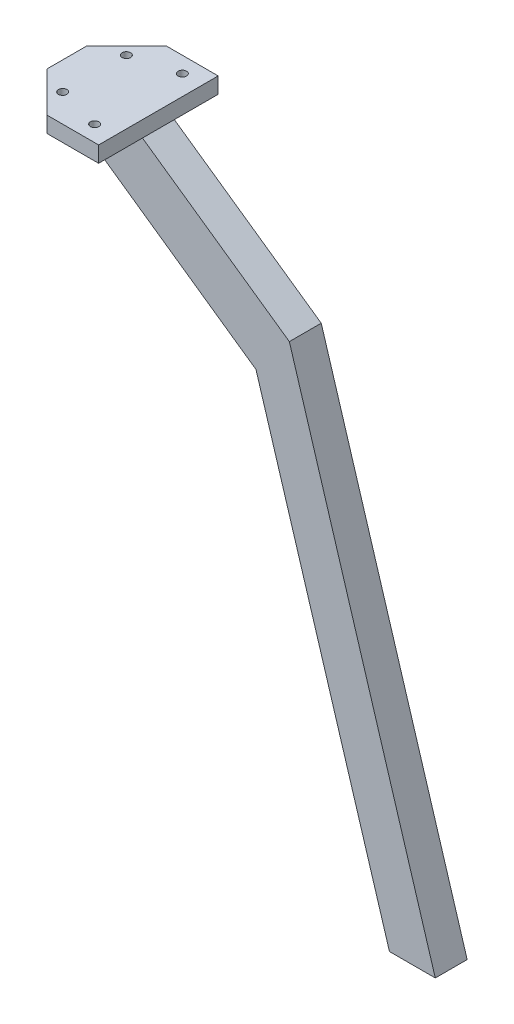
ISO-10303-21;
HEADER;
FILE_DESCRIPTION(('STEP AP214'),'2;1');
FILE_NAME('part.step','',(''),(''),'','','');
FILE_SCHEMA(('AUTOMOTIVE_DESIGN { 1 0 10303 214 1 1 1 1 }'));
ENDSEC;
DATA;
#1=APPLICATION_CONTEXT('core data for automotive mechanical design processes');
#2=APPLICATION_PROTOCOL_DEFINITION('international standard','automotive_design',2000,#1);
#3=PRODUCT_CONTEXT('',#1,'mechanical');
#4=PRODUCT('Part','Part','',(#3));
#5=PRODUCT_RELATED_PRODUCT_CATEGORY('part','',(#4));
#6=PRODUCT_DEFINITION_FORMATION('','',#4);
#7=PRODUCT_DEFINITION_CONTEXT('part definition',#1,'design');
#8=PRODUCT_DEFINITION('design','',#6,#7);
#9=PRODUCT_DEFINITION_SHAPE('','',#8);
#10=(LENGTH_UNIT() NAMED_UNIT(*) SI_UNIT(.MILLI.,.METRE.));
#11=(NAMED_UNIT(*) PLANE_ANGLE_UNIT() SI_UNIT($,.RADIAN.));
#12=(NAMED_UNIT(*) SI_UNIT($,.STERADIAN.) SOLID_ANGLE_UNIT());
#13=UNCERTAINTY_MEASURE_WITH_UNIT(LENGTH_MEASURE(1.E-05),#10,'distance_accuracy_value','');
#14=(GEOMETRIC_REPRESENTATION_CONTEXT(3) GLOBAL_UNCERTAINTY_ASSIGNED_CONTEXT((#13)) GLOBAL_UNIT_ASSIGNED_CONTEXT((#10,
#11,#12)) REPRESENTATION_CONTEXT('',''));
#15=CARTESIAN_POINT('',(0.,0.,0.));
#16=DIRECTION('',(0.,0.,1.));
#17=DIRECTION('',(1.,0.,0.));
#18=AXIS2_PLACEMENT_3D('',#15,#16,#17);
#19=CARTESIAN_POINT('',(0.,0.,0.));
#20=DIRECTION('',(0.,-1.,0.));
#21=DIRECTION('',(0.,0.,-1.));
#22=AXIS2_PLACEMENT_3D('',#19,#20,#21);
#23=PLANE('',#22);
#24=CARTESIAN_POINT('',(6.96945989785264,0.,-23.));
#25=DIRECTION('',(0.,1.,0.));
#26=DIRECTION('',(0.,0.,1.));
#27=AXIS2_PLACEMENT_3D('',#24,#25,#26);
#28=CIRCLE('',#27,1.06398593230415);
#29=CARTESIAN_POINT('',(6.96945989785264,0.,-21.9360140676959));
#30=VERTEX_POINT('',#29);
#31=EDGE_CURVE('E184',#30,#30,#28,.T.);
#32=ORIENTED_EDGE('',*,*,#31,.T.);
#33=EDGE_LOOP('',(#32));
#34=FACE_BOUND('',#33,.T.);
#35=CARTESIAN_POINT('',(18.,0.,-26.));
#36=DIRECTION('',(0.,1.,0.));
#37=DIRECTION('',(0.,0.,1.));
#38=AXIS2_PLACEMENT_3D('',#35,#36,#37);
#39=CIRCLE('',#38,1.06398593230415);
#40=CARTESIAN_POINT('',(18.,0.,-24.9360140676959));
#41=VERTEX_POINT('',#40);
#42=EDGE_CURVE('E183',#41,#41,#39,.T.);
#43=ORIENTED_EDGE('',*,*,#42,.T.);
#44=EDGE_LOOP('',(#43));
#45=FACE_BOUND('',#44,.T.);
#46=DIRECTION('',(0.,0.,-1.));
#47=VECTOR('',#46,1.);
#48=CARTESIAN_POINT('',(23.,0.,0.));
#49=LINE('',#48,#47);
#50=CARTESIAN_POINT('',(23.,0.,-19.));
#51=VERTEX_POINT('',#50);
#52=CARTESIAN_POINT('',(23.,0.,-30.));
#53=VERTEX_POINT('',#52);
#54=EDGE_CURVE('E141',#51,#53,#49,.T.);
#55=ORIENTED_EDGE('',*,*,#54,.F.);
#56=DIRECTION('',(-1.,0.,0.));
#57=VECTOR('',#56,1.);
#58=CARTESIAN_POINT('',(0.,0.,-19.));
#59=LINE('',#58,#57);
#60=CARTESIAN_POINT('',(0.,0.,-19.));
#61=VERTEX_POINT('',#60);
#62=EDGE_CURVE('E162',#51,#61,#59,.T.);
#63=ORIENTED_EDGE('',*,*,#62,.T.);
#64=DIRECTION('',(0.,0.,1.));
#65=VECTOR('',#64,1.);
#66=CARTESIAN_POINT('',(0.,0.,-10.));
#67=LINE('',#66,#65);
#68=CARTESIAN_POINT('',(0.,0.,-20.));
#69=VERTEX_POINT('',#68);
#70=EDGE_CURVE('E145',#69,#61,#67,.T.);
#71=ORIENTED_EDGE('',*,*,#70,.F.);
#72=DIRECTION('',(-0.707106781186547,0.,0.707106781186548));
#73=VECTOR('',#72,1.);
#74=CARTESIAN_POINT('',(0.,0.,-20.));
#75=LINE('',#74,#73);
#76=CARTESIAN_POINT('',(10.,0.,-30.));
#77=VERTEX_POINT('',#76);
#78=EDGE_CURVE('E143',#77,#69,#75,.T.);
#79=ORIENTED_EDGE('',*,*,#78,.F.);
#80=DIRECTION('',(-1.,0.,0.));
#81=VECTOR('',#80,1.);
#82=CARTESIAN_POINT('',(10.,0.,-30.));
#83=LINE('',#82,#81);
#84=EDGE_CURVE('E140',#53,#77,#83,.T.);
#85=ORIENTED_EDGE('',*,*,#84,.F.);
#86=EDGE_LOOP('',(#55,#63,#71,#79,#85));
#87=FACE_BOUND('',#86,.T.);
#88=ADVANCED_FACE('F38',(#34,#45,#87),#23,.T.);
#89=CARTESIAN_POINT('',(0.,4.,0.));
#90=DIRECTION('',(0.,-1.,0.));
#91=DIRECTION('',(0.,0.,-1.));
#92=AXIS2_PLACEMENT_3D('',#89,#90,#91);
#93=PLANE('',#92);
#94=DIRECTION('',(0.,0.,-1.));
#95=VECTOR('',#94,1.);
#96=CARTESIAN_POINT('',(23.,4.,0.));
#97=LINE('',#96,#95);
#98=CARTESIAN_POINT('',(23.,4.,0.));
#99=VERTEX_POINT('',#98);
#100=CARTESIAN_POINT('',(23.,4.,-30.));
#101=VERTEX_POINT('',#100);
#102=EDGE_CURVE('E150',#99,#101,#97,.T.);
#103=ORIENTED_EDGE('',*,*,#102,.T.);
#104=DIRECTION('',(-1.,0.,0.));
#105=VECTOR('',#104,1.);
#106=CARTESIAN_POINT('',(10.,4.,-30.));
#107=LINE('',#106,#105);
#108=CARTESIAN_POINT('',(10.,4.,-30.));
#109=VERTEX_POINT('',#108);
#110=EDGE_CURVE('E97',#101,#109,#107,.T.);
#111=ORIENTED_EDGE('',*,*,#110,.T.);
#112=DIRECTION('',(-0.707106781186547,0.,0.707106781186548));
#113=VECTOR('',#112,1.);
#114=CARTESIAN_POINT('',(0.,4.,-20.));
#115=LINE('',#114,#113);
#116=CARTESIAN_POINT('',(0.,4.,-20.));
#117=VERTEX_POINT('',#116);
#118=EDGE_CURVE('E114',#109,#117,#115,.T.);
#119=ORIENTED_EDGE('',*,*,#118,.T.);
#120=DIRECTION('',(0.,0.,1.));
#121=VECTOR('',#120,1.);
#122=CARTESIAN_POINT('',(0.,4.,-10.));
#123=LINE('',#122,#121);
#124=CARTESIAN_POINT('',(0.,4.,-10.));
#125=VERTEX_POINT('',#124);
#126=EDGE_CURVE('E106',#117,#125,#123,.T.);
#127=ORIENTED_EDGE('',*,*,#126,.T.);
#128=DIRECTION('',(0.707106781186548,0.,0.707106781186547));
#129=VECTOR('',#128,1.);
#130=CARTESIAN_POINT('',(10.,4.,0.));
#131=LINE('',#130,#129);
#132=CARTESIAN_POINT('',(10.,4.,0.));
#133=VERTEX_POINT('',#132);
#134=EDGE_CURVE('E111',#125,#133,#131,.T.);
#135=ORIENTED_EDGE('',*,*,#134,.T.);
#136=DIRECTION('',(1.,0.,0.));
#137=VECTOR('',#136,1.);
#138=CARTESIAN_POINT('',(10.,4.,0.));
#139=LINE('',#138,#137);
#140=EDGE_CURVE('E62',#133,#99,#139,.T.);
#141=ORIENTED_EDGE('',*,*,#140,.T.);
#142=EDGE_LOOP('',(#103,#111,#119,#127,#135,#141));
#143=FACE_BOUND('',#142,.T.);
#144=CARTESIAN_POINT('',(6.96945989785264,4.,-7.));
#145=DIRECTION('',(0.,1.,0.));
#146=DIRECTION('',(0.,0.,1.));
#147=AXIS2_PLACEMENT_3D('',#144,#145,#146);
#148=CIRCLE('',#147,1.06398593230415);
#149=CARTESIAN_POINT('',(6.96945989785264,4.,-5.93601406769585));
#150=VERTEX_POINT('',#149);
#151=EDGE_CURVE('E200',#150,#150,#148,.T.);
#152=ORIENTED_EDGE('',*,*,#151,.F.);
#153=EDGE_LOOP('',(#152));
#154=FACE_BOUND('',#153,.T.);
#155=CARTESIAN_POINT('',(18.,4.,-4.));
#156=DIRECTION('',(0.,1.,0.));
#157=DIRECTION('',(0.,0.,1.));
#158=AXIS2_PLACEMENT_3D('',#155,#156,#157);
#159=CIRCLE('',#158,1.06398593230415);
#160=CARTESIAN_POINT('',(18.,4.,-2.93601406769585));
#161=VERTEX_POINT('',#160);
#162=EDGE_CURVE('E194',#161,#161,#159,.T.);
#163=ORIENTED_EDGE('',*,*,#162,.F.);
#164=EDGE_LOOP('',(#163));
#165=FACE_BOUND('',#164,.T.);
#166=CARTESIAN_POINT('',(18.,4.,-26.));
#167=DIRECTION('',(0.,1.,0.));
#168=DIRECTION('',(0.,0.,1.));
#169=AXIS2_PLACEMENT_3D('',#166,#167,#168);
#170=CIRCLE('',#169,1.06398593230415);
#171=CARTESIAN_POINT('',(18.,4.,-24.9360140676959));
#172=VERTEX_POINT('',#171);
#173=EDGE_CURVE('E188',#172,#172,#170,.T.);
#174=ORIENTED_EDGE('',*,*,#173,.F.);
#175=EDGE_LOOP('',(#174));
#176=FACE_BOUND('',#175,.T.);
#177=CARTESIAN_POINT('',(6.96945989785264,4.,-23.));
#178=DIRECTION('',(0.,1.,0.));
#179=DIRECTION('',(0.,0.,1.));
#180=AXIS2_PLACEMENT_3D('',#177,#178,#179);
#181=CIRCLE('',#180,1.06398593230415);
#182=CARTESIAN_POINT('',(6.96945989785264,4.,-21.9360140676959));
#183=VERTEX_POINT('',#182);
#184=EDGE_CURVE('E180',#183,#183,#181,.T.);
#185=ORIENTED_EDGE('',*,*,#184,.F.);
#186=EDGE_LOOP('',(#185));
#187=FACE_BOUND('',#186,.T.);
#188=ADVANCED_FACE('F108',(#143,#154,#165,#176,#187),#93,.F.);
#189=DIRECTION('',(-1.,0.,0.));
#190=VECTOR('',#189,1.);
#191=CARTESIAN_POINT('',(0.,0.,-11.));
#192=LINE('',#191,#190);
#193=CARTESIAN_POINT('',(23.,0.,-11.));
#194=VERTEX_POINT('',#193);
#195=CARTESIAN_POINT('',(0.,0.,-11.));
#196=VERTEX_POINT('',#195);
#197=EDGE_CURVE('E236',#194,#196,#192,.T.);
#198=ORIENTED_EDGE('',*,*,#197,.F.);
#199=CARTESIAN_POINT('',(23.,0.,0.));
#200=VERTEX_POINT('',#199);
#201=EDGE_CURVE('E137',#200,#194,#49,.T.);
#202=ORIENTED_EDGE('',*,*,#201,.F.);
#203=DIRECTION('',(1.,0.,0.));
#204=VECTOR('',#203,1.);
#205=CARTESIAN_POINT('',(10.,0.,0.));
#206=LINE('',#205,#204);
#207=CARTESIAN_POINT('',(10.,0.,0.));
#208=VERTEX_POINT('',#207);
#209=EDGE_CURVE('E89',#208,#200,#206,.T.);
#210=ORIENTED_EDGE('',*,*,#209,.F.);
#211=DIRECTION('',(0.707106781186548,0.,0.707106781186547));
#212=VECTOR('',#211,1.);
#213=CARTESIAN_POINT('',(10.,0.,0.));
#214=LINE('',#213,#212);
#215=CARTESIAN_POINT('',(0.,0.,-10.));
#216=VERTEX_POINT('',#215);
#217=EDGE_CURVE('E147',#216,#208,#214,.T.);
#218=ORIENTED_EDGE('',*,*,#217,.F.);
#219=EDGE_CURVE('E125',#196,#216,#67,.T.);
#220=ORIENTED_EDGE('',*,*,#219,.F.);
#221=EDGE_LOOP('',(#198,#202,#210,#218,#220));
#222=FACE_BOUND('',#221,.T.);
#223=CARTESIAN_POINT('',(6.96945989785264,0.,-7.));
#224=DIRECTION('',(0.,1.,0.));
#225=DIRECTION('',(0.,0.,1.));
#226=AXIS2_PLACEMENT_3D('',#223,#224,#225);
#227=CIRCLE('',#226,1.06398593230415);
#228=CARTESIAN_POINT('',(6.96945989785264,0.,-5.93601406769585));
#229=VERTEX_POINT('',#228);
#230=EDGE_CURVE('E197',#229,#229,#227,.T.);
#231=ORIENTED_EDGE('',*,*,#230,.T.);
#232=EDGE_LOOP('',(#231));
#233=FACE_BOUND('',#232,.T.);
#234=CARTESIAN_POINT('',(18.,0.,-4.));
#235=DIRECTION('',(0.,1.,0.));
#236=DIRECTION('',(0.,0.,1.));
#237=AXIS2_PLACEMENT_3D('',#234,#235,#236);
#238=CIRCLE('',#237,1.06398593230415);
#239=CARTESIAN_POINT('',(18.,0.,-2.93601406769585));
#240=VERTEX_POINT('',#239);
#241=EDGE_CURVE('E191',#240,#240,#238,.T.);
#242=ORIENTED_EDGE('',*,*,#241,.T.);
#243=EDGE_LOOP('',(#242));
#244=FACE_BOUND('',#243,.T.);
#245=ADVANCED_FACE('F217',(#222,#233,#244),#23,.T.);
#246=CARTESIAN_POINT('',(23.,4.,0.));
#247=DIRECTION('',(-1.,0.,0.));
#248=DIRECTION('',(0.,0.,1.));
#249=AXIS2_PLACEMENT_3D('',#246,#247,#248);
#250=PLANE('',#249);
#251=ORIENTED_EDGE('',*,*,#201,.T.);
#252=DIRECTION('',(0.,0.,1.));
#253=VECTOR('',#252,1.);
#254=CARTESIAN_POINT('',(23.,0.,-19.));
#255=LINE('',#254,#253);
#256=EDGE_CURVE('E187',#51,#194,#255,.T.);
#257=ORIENTED_EDGE('',*,*,#256,.F.);
#258=ORIENTED_EDGE('',*,*,#54,.T.);
#259=DIRECTION('',(0.,-1.,0.));
#260=VECTOR('',#259,1.);
#261=CARTESIAN_POINT('',(23.,4.,-30.));
#262=LINE('',#261,#260);
#263=EDGE_CURVE('E11',#101,#53,#262,.T.);
#264=ORIENTED_EDGE('',*,*,#263,.F.);
#265=ORIENTED_EDGE('',*,*,#102,.F.);
#266=DIRECTION('',(0.,-1.,0.));
#267=VECTOR('',#266,1.);
#268=CARTESIAN_POINT('',(23.,4.,0.));
#269=LINE('',#268,#267);
#270=EDGE_CURVE('E133',#99,#200,#269,.T.);
#271=ORIENTED_EDGE('',*,*,#270,.T.);
#272=EDGE_LOOP('',(#251,#257,#258,#264,#265,#271));
#273=FACE_BOUND('',#272,.T.);
#274=ADVANCED_FACE('F40',(#273),#250,.F.);
#275=CARTESIAN_POINT('',(10.,4.,-30.));
#276=DIRECTION('',(0.,0.,1.));
#277=DIRECTION('',(1.,0.,0.));
#278=AXIS2_PLACEMENT_3D('',#275,#276,#277);
#279=PLANE('',#278);
#280=ORIENTED_EDGE('',*,*,#84,.T.);
#281=DIRECTION('',(0.,-1.,0.));
#282=VECTOR('',#281,1.);
#283=CARTESIAN_POINT('',(10.,4.,-30.));
#284=LINE('',#283,#282);
#285=EDGE_CURVE('E46',#109,#77,#284,.T.);
#286=ORIENTED_EDGE('',*,*,#285,.F.);
#287=ORIENTED_EDGE('',*,*,#110,.F.);
#288=ORIENTED_EDGE('',*,*,#263,.T.);
#289=EDGE_LOOP('',(#280,#286,#287,#288));
#290=FACE_BOUND('',#289,.T.);
#291=ADVANCED_FACE('F210',(#290),#279,.F.);
#292=CARTESIAN_POINT('',(0.,4.,-20.));
#293=DIRECTION('',(0.707106781186548,0.,0.707106781186547));
#294=DIRECTION('',(0.707106781186547,0.,-0.707106781186548));
#295=AXIS2_PLACEMENT_3D('',#292,#293,#294);
#296=PLANE('',#295);
#297=ORIENTED_EDGE('',*,*,#78,.T.);
#298=DIRECTION('',(0.,-1.,0.));
#299=VECTOR('',#298,1.);
#300=CARTESIAN_POINT('',(0.,4.,-20.));
#301=LINE('',#300,#299);
#302=EDGE_CURVE('E128',#117,#69,#301,.T.);
#303=ORIENTED_EDGE('',*,*,#302,.F.);
#304=ORIENTED_EDGE('',*,*,#118,.F.);
#305=ORIENTED_EDGE('',*,*,#285,.T.);
#306=EDGE_LOOP('',(#297,#303,#304,#305));
#307=FACE_BOUND('',#306,.T.);
#308=ADVANCED_FACE('F156',(#307),#296,.F.);
#309=CARTESIAN_POINT('',(0.,4.,-10.));
#310=DIRECTION('',(1.,0.,0.));
#311=DIRECTION('',(0.,0.,-1.));
#312=AXIS2_PLACEMENT_3D('',#309,#310,#311);
#313=PLANE('',#312);
#314=ORIENTED_EDGE('',*,*,#70,.T.);
#315=DIRECTION('',(0.,0.,1.));
#316=VECTOR('',#315,1.);
#317=CARTESIAN_POINT('',(0.,0.,-19.));
#318=LINE('',#317,#316);
#319=EDGE_CURVE('E164',#61,#196,#318,.T.);
#320=ORIENTED_EDGE('',*,*,#319,.T.);
#321=ORIENTED_EDGE('',*,*,#219,.T.);
#322=DIRECTION('',(0.,-1.,0.));
#323=VECTOR('',#322,1.);
#324=CARTESIAN_POINT('',(0.,4.,-10.));
#325=LINE('',#324,#323);
#326=EDGE_CURVE('E120',#125,#216,#325,.T.);
#327=ORIENTED_EDGE('',*,*,#326,.F.);
#328=ORIENTED_EDGE('',*,*,#126,.F.);
#329=ORIENTED_EDGE('',*,*,#302,.T.);
#330=EDGE_LOOP('',(#314,#320,#321,#327,#328,#329));
#331=FACE_BOUND('',#330,.T.);
#332=ADVANCED_FACE('F122',(#331),#313,.F.);
#333=CARTESIAN_POINT('',(10.,4.,0.));
#334=DIRECTION('',(0.707106781186547,0.,-0.707106781186548));
#335=DIRECTION('',(-0.707106781186548,0.,-0.707106781186547));
#336=AXIS2_PLACEMENT_3D('',#333,#334,#335);
#337=PLANE('',#336);
#338=ORIENTED_EDGE('',*,*,#217,.T.);
#339=DIRECTION('',(0.,-1.,0.));
#340=VECTOR('',#339,1.);
#341=CARTESIAN_POINT('',(10.,4.,0.));
#342=LINE('',#341,#340);
#343=EDGE_CURVE('E129',#133,#208,#342,.T.);
#344=ORIENTED_EDGE('',*,*,#343,.F.);
#345=ORIENTED_EDGE('',*,*,#134,.F.);
#346=ORIENTED_EDGE('',*,*,#326,.T.);
#347=EDGE_LOOP('',(#338,#344,#345,#346));
#348=FACE_BOUND('',#347,.T.);
#349=ADVANCED_FACE('F131',(#348),#337,.F.);
#350=CARTESIAN_POINT('',(10.,4.,0.));
#351=DIRECTION('',(0.,0.,-1.));
#352=DIRECTION('',(-1.,0.,0.));
#353=AXIS2_PLACEMENT_3D('',#350,#351,#352);
#354=PLANE('',#353);
#355=ORIENTED_EDGE('',*,*,#209,.T.);
#356=ORIENTED_EDGE('',*,*,#270,.F.);
#357=ORIENTED_EDGE('',*,*,#140,.F.);
#358=ORIENTED_EDGE('',*,*,#343,.T.);
#359=EDGE_LOOP('',(#355,#356,#357,#358));
#360=FACE_BOUND('',#359,.T.);
#361=ADVANCED_FACE('F254',(#360),#354,.F.);
#362=CARTESIAN_POINT('',(6.96945989785264,4.,-7.));
#363=DIRECTION('',(0.,-1.,0.));
#364=DIRECTION('',(0.,0.,-1.));
#365=AXIS2_PLACEMENT_3D('',#362,#363,#364);
#366=CYLINDRICAL_SURFACE('',#365,1.06398593230415);
#367=ORIENTED_EDGE('',*,*,#151,.T.);
#368=EDGE_LOOP('',(#367));
#369=FACE_BOUND('',#368,.T.);
#370=ORIENTED_EDGE('',*,*,#230,.F.);
#371=EDGE_LOOP('',(#370));
#372=FACE_BOUND('',#371,.T.);
#373=ADVANCED_FACE('F244',(#369,#372),#366,.F.);
#374=CARTESIAN_POINT('',(18.,4.,-4.));
#375=DIRECTION('',(0.,-1.,0.));
#376=DIRECTION('',(0.,0.,-1.));
#377=AXIS2_PLACEMENT_3D('',#374,#375,#376);
#378=CYLINDRICAL_SURFACE('',#377,1.06398593230415);
#379=ORIENTED_EDGE('',*,*,#162,.T.);
#380=EDGE_LOOP('',(#379));
#381=FACE_BOUND('',#380,.T.);
#382=ORIENTED_EDGE('',*,*,#241,.F.);
#383=EDGE_LOOP('',(#382));
#384=FACE_BOUND('',#383,.T.);
#385=ADVANCED_FACE('F241',(#381,#384),#378,.F.);
#386=CARTESIAN_POINT('',(18.,4.,-26.));
#387=DIRECTION('',(0.,-1.,0.));
#388=DIRECTION('',(0.,0.,-1.));
#389=AXIS2_PLACEMENT_3D('',#386,#387,#388);
#390=CYLINDRICAL_SURFACE('',#389,1.06398593230415);
#391=ORIENTED_EDGE('',*,*,#173,.T.);
#392=EDGE_LOOP('',(#391));
#393=FACE_BOUND('',#392,.T.);
#394=ORIENTED_EDGE('',*,*,#42,.F.);
#395=EDGE_LOOP('',(#394));
#396=FACE_BOUND('',#395,.T.);
#397=ADVANCED_FACE('F243',(#393,#396),#390,.F.);
#398=CARTESIAN_POINT('',(6.96945989785264,4.,-23.));
#399=DIRECTION('',(0.,-1.,0.));
#400=DIRECTION('',(0.,0.,-1.));
#401=AXIS2_PLACEMENT_3D('',#398,#399,#400);
#402=CYLINDRICAL_SURFACE('',#401,1.06398593230415);
#403=ORIENTED_EDGE('',*,*,#184,.T.);
#404=EDGE_LOOP('',(#403));
#405=FACE_BOUND('',#404,.T.);
#406=ORIENTED_EDGE('',*,*,#31,.F.);
#407=EDGE_LOOP('',(#406));
#408=FACE_BOUND('',#407,.T.);
#409=ADVANCED_FACE('F251',(#405,#408),#402,.F.);
#410=CARTESIAN_POINT('',(59.8618419930048,-25.8109396357969,-19.));
#411=DIRECTION('',(0.573576436351041,0.819152044288995,0.));
#412=DIRECTION('',(-0.819152044288995,0.573576436351041,0.));
#413=AXIS2_PLACEMENT_3D('',#410,#411,#412);
#414=PLANE('',#413);
#415=ORIENTED_EDGE('',*,*,#256,.T.);
#416=DIRECTION('',(-0.819152044288995,0.573576436351041,0.));
#417=VECTOR('',#416,1.);
#418=CARTESIAN_POINT('',(59.8618419930048,-25.8109396357969,-11.));
#419=LINE('',#418,#417);
#420=CARTESIAN_POINT('',(59.8618419930048,-25.8109396357969,-11.));
#421=VERTEX_POINT('',#420);
#422=EDGE_CURVE('E295',#421,#194,#419,.T.);
#423=ORIENTED_EDGE('',*,*,#422,.F.);
#424=DIRECTION('',(0.,0.,1.));
#425=VECTOR('',#424,1.);
#426=CARTESIAN_POINT('',(59.8618419930048,-25.8109396357969,-19.));
#427=LINE('',#426,#425);
#428=CARTESIAN_POINT('',(59.8618419930048,-25.8109396357969,-19.));
#429=VERTEX_POINT('',#428);
#430=EDGE_CURVE('E315',#429,#421,#427,.T.);
#431=ORIENTED_EDGE('',*,*,#430,.F.);
#432=DIRECTION('',(-0.819152044288995,0.573576436351041,0.));
#433=VECTOR('',#432,1.);
#434=CARTESIAN_POINT('',(59.8618419930048,-25.8109396357969,-19.));
#435=LINE('',#434,#433);
#436=EDGE_CURVE('E170',#429,#51,#435,.T.);
#437=ORIENTED_EDGE('',*,*,#436,.T.);
#438=EDGE_LOOP('',(#415,#423,#431,#437));
#439=FACE_BOUND('',#438,.T.);
#440=ADVANCED_FACE('F260',(#439),#414,.T.);
#441=CARTESIAN_POINT('',(96.4862455768699,-145.810939635797,-19.));
#442=DIRECTION('',(0.956445659555141,0.291910432013196,0.));
#443=DIRECTION('',(-0.291910432013196,0.956445659555141,0.));
#444=AXIS2_PLACEMENT_3D('',#441,#442,#443);
#445=PLANE('',#444);
#446=ORIENTED_EDGE('',*,*,#430,.T.);
#447=DIRECTION('',(-0.291910432013196,0.956445659555141,0.));
#448=VECTOR('',#447,1.);
#449=CARTESIAN_POINT('',(96.4862455768699,-145.810939635797,-11.));
#450=LINE('',#449,#448);
#451=CARTESIAN_POINT('',(96.4862455768699,-145.810939635797,-11.));
#452=VERTEX_POINT('',#451);
#453=EDGE_CURVE('E322',#452,#421,#450,.T.);
#454=ORIENTED_EDGE('',*,*,#453,.F.);
#455=DIRECTION('',(0.,0.,1.));
#456=VECTOR('',#455,1.);
#457=CARTESIAN_POINT('',(96.4862455768699,-145.810939635797,-19.));
#458=LINE('',#457,#456);
#459=CARTESIAN_POINT('',(96.4862455768699,-145.810939635797,-19.));
#460=VERTEX_POINT('',#459);
#461=EDGE_CURVE('E334',#460,#452,#458,.T.);
#462=ORIENTED_EDGE('',*,*,#461,.F.);
#463=DIRECTION('',(-0.291910432013196,0.956445659555141,0.));
#464=VECTOR('',#463,1.);
#465=CARTESIAN_POINT('',(96.4862455768699,-145.810939635797,-19.));
#466=LINE('',#465,#464);
#467=EDGE_CURVE('E176',#460,#429,#466,.T.);
#468=ORIENTED_EDGE('',*,*,#467,.T.);
#469=EDGE_LOOP('',(#446,#454,#462,#468));
#470=FACE_BOUND('',#469,.T.);
#471=ADVANCED_FACE('F273',(#470),#445,.T.);
#472=CARTESIAN_POINT('',(84.9853308201274,-145.810939635797,-19.));
#473=DIRECTION('',(0.,-1.,0.));
#474=DIRECTION('',(0.,0.,-1.));
#475=AXIS2_PLACEMENT_3D('',#472,#473,#474);
#476=PLANE('',#475);
#477=ORIENTED_EDGE('',*,*,#461,.T.);
#478=DIRECTION('',(1.,0.,0.));
#479=VECTOR('',#478,1.);
#480=CARTESIAN_POINT('',(84.9853308201274,-145.810939635797,-11.));
#481=LINE('',#480,#479);
#482=CARTESIAN_POINT('',(84.9853308201274,-145.810939635797,-11.));
#483=VERTEX_POINT('',#482);
#484=EDGE_CURVE('E343',#483,#452,#481,.T.);
#485=ORIENTED_EDGE('',*,*,#484,.F.);
#486=DIRECTION('',(0.,0.,1.));
#487=VECTOR('',#486,1.);
#488=CARTESIAN_POINT('',(84.9853308201274,-145.810939635797,-19.));
#489=LINE('',#488,#487);
#490=CARTESIAN_POINT('',(84.9853308201274,-145.810939635797,-19.));
#491=VERTEX_POINT('',#490);
#492=EDGE_CURVE('E173',#491,#483,#489,.T.);
#493=ORIENTED_EDGE('',*,*,#492,.F.);
#494=DIRECTION('',(1.,0.,0.));
#495=VECTOR('',#494,1.);
#496=CARTESIAN_POINT('',(84.9853308201274,-145.810939635797,-19.));
#497=LINE('',#496,#495);
#498=EDGE_CURVE('E328',#491,#460,#497,.T.);
#499=ORIENTED_EDGE('',*,*,#498,.T.);
#500=EDGE_LOOP('',(#477,#485,#493,#499));
#501=FACE_BOUND('',#500,.T.);
#502=ADVANCED_FACE('F269',(#501),#476,.T.);
#503=CARTESIAN_POINT('',(51.4862455768699,-36.0510572670402,-19.));
#504=DIRECTION('',(-0.956445659555141,-0.291910432013196,0.));
#505=DIRECTION('',(0.291910432013196,-0.956445659555141,0.));
#506=AXIS2_PLACEMENT_3D('',#503,#504,#505);
#507=PLANE('',#506);
#508=ORIENTED_EDGE('',*,*,#492,.T.);
#509=DIRECTION('',(0.291910432013196,-0.956445659555141,0.));
#510=VECTOR('',#509,1.);
#511=CARTESIAN_POINT('',(51.4862455768699,-36.0510572670402,-11.));
#512=LINE('',#511,#510);
#513=CARTESIAN_POINT('',(51.4862455768699,-36.0510572670402,-11.));
#514=VERTEX_POINT('',#513);
#515=EDGE_CURVE('E338',#514,#483,#512,.T.);
#516=ORIENTED_EDGE('',*,*,#515,.F.);
#517=DIRECTION('',(0.,0.,1.));
#518=VECTOR('',#517,1.);
#519=CARTESIAN_POINT('',(51.4862455768699,-36.0510572670402,-19.));
#520=LINE('',#519,#518);
#521=CARTESIAN_POINT('',(51.4862455768699,-36.0510572670402,-19.));
#522=VERTEX_POINT('',#521);
#523=EDGE_CURVE('E169',#522,#514,#520,.T.);
#524=ORIENTED_EDGE('',*,*,#523,.F.);
#525=DIRECTION('',(0.291910432013196,-0.956445659555141,0.));
#526=VECTOR('',#525,1.);
#527=CARTESIAN_POINT('',(51.4862455768699,-36.0510572670402,-19.));
#528=LINE('',#527,#526);
#529=EDGE_CURVE('E320',#522,#491,#528,.T.);
#530=ORIENTED_EDGE('',*,*,#529,.T.);
#531=EDGE_LOOP('',(#508,#516,#524,#530));
#532=FACE_BOUND('',#531,.T.);
#533=ADVANCED_FACE('F266',(#532),#507,.T.);
#534=CARTESIAN_POINT('',(0.,0.,-19.));
#535=DIRECTION('',(-0.573576436351042,-0.819152044288995,0.));
#536=DIRECTION('',(0.819152044288995,-0.573576436351042,0.));
#537=AXIS2_PLACEMENT_3D('',#534,#535,#536);
#538=PLANE('',#537);
#539=ORIENTED_EDGE('',*,*,#523,.T.);
#540=DIRECTION('',(0.819152044288995,-0.573576436351042,0.));
#541=VECTOR('',#540,1.);
#542=CARTESIAN_POINT('',(0.,0.,-11.));
#543=LINE('',#542,#541);
#544=EDGE_CURVE('E291',#196,#514,#543,.T.);
#545=ORIENTED_EDGE('',*,*,#544,.F.);
#546=ORIENTED_EDGE('',*,*,#319,.F.);
#547=DIRECTION('',(0.819152044288995,-0.573576436351042,0.));
#548=VECTOR('',#547,1.);
#549=CARTESIAN_POINT('',(0.,0.,-19.));
#550=LINE('',#549,#548);
#551=EDGE_CURVE('E53',#61,#522,#550,.T.);
#552=ORIENTED_EDGE('',*,*,#551,.T.);
#553=EDGE_LOOP('',(#539,#545,#546,#552));
#554=FACE_BOUND('',#553,.T.);
#555=ADVANCED_FACE('F262',(#554),#538,.T.);
#556=CARTESIAN_POINT('',(0.,0.,-19.));
#557=DIRECTION('',(0.,0.,1.));
#558=DIRECTION('',(1.,0.,0.));
#559=AXIS2_PLACEMENT_3D('',#556,#557,#558);
#560=PLANE('',#559);
#561=ORIENTED_EDGE('',*,*,#62,.F.);
#562=ORIENTED_EDGE('',*,*,#436,.F.);
#563=ORIENTED_EDGE('',*,*,#467,.F.);
#564=ORIENTED_EDGE('',*,*,#498,.F.);
#565=ORIENTED_EDGE('',*,*,#529,.F.);
#566=ORIENTED_EDGE('',*,*,#551,.F.);
#567=EDGE_LOOP('',(#561,#562,#563,#564,#565,#566));
#568=FACE_BOUND('',#567,.T.);
#569=ADVANCED_FACE('F265',(#568),#560,.F.);
#570=CARTESIAN_POINT('',(0.,0.,-11.));
#571=DIRECTION('',(0.,0.,1.));
#572=DIRECTION('',(1.,0.,0.));
#573=AXIS2_PLACEMENT_3D('',#570,#571,#572);
#574=PLANE('',#573);
#575=ORIENTED_EDGE('',*,*,#197,.T.);
#576=ORIENTED_EDGE('',*,*,#544,.T.);
#577=ORIENTED_EDGE('',*,*,#515,.T.);
#578=ORIENTED_EDGE('',*,*,#484,.T.);
#579=ORIENTED_EDGE('',*,*,#453,.T.);
#580=ORIENTED_EDGE('',*,*,#422,.T.);
#581=EDGE_LOOP('',(#575,#576,#577,#578,#579,#580));
#582=FACE_BOUND('',#581,.T.);
#583=ADVANCED_FACE('F283',(#582),#574,.T.);
#584=CLOSED_SHELL('',(#88,#188,#245,#274,#291,#308,#332,#349,#361,#373,#385,#397,#409,#440,#471,
#502,#533,#555,#569,#583));
#585=MANIFOLD_SOLID_BREP('B2',#584);
#586=ADVANCED_BREP_SHAPE_REPRESENTATION('',(#18,#585),#14);
#587=SHAPE_DEFINITION_REPRESENTATION(#9,#586);
ENDSEC;
END-ISO-10303-21;
